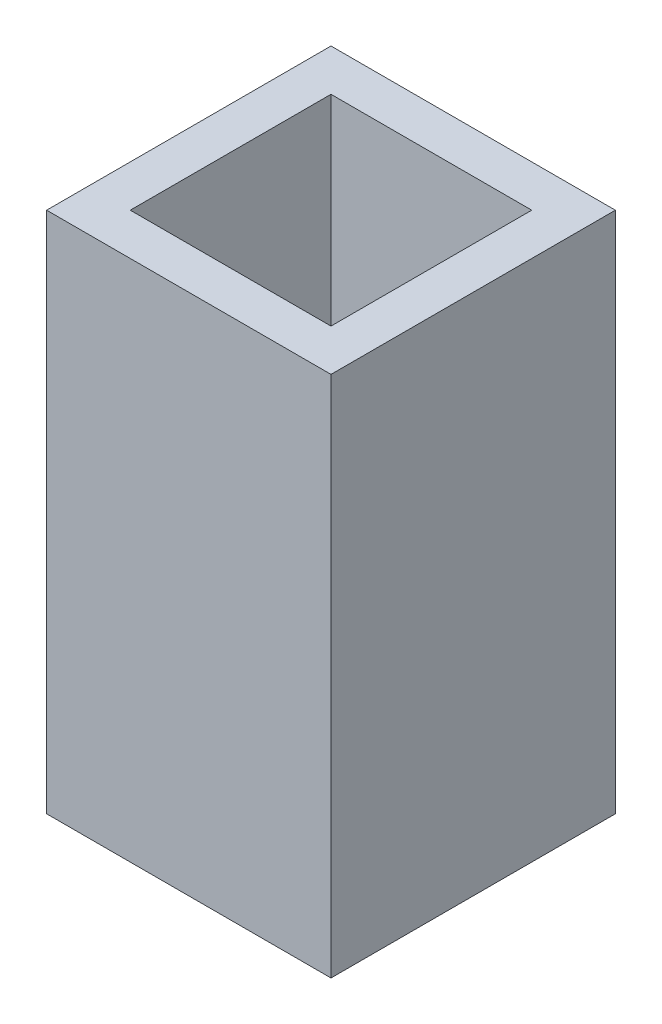
ISO-10303-21;
HEADER;
FILE_DESCRIPTION(('STEP AP214'),'2;1');
FILE_NAME('part.step','',(''),(''),'','','');
FILE_SCHEMA(('AUTOMOTIVE_DESIGN { 1 0 10303 214 1 1 1 1 }'));
ENDSEC;
DATA;
#1=APPLICATION_CONTEXT('core data for automotive mechanical design processes');
#2=APPLICATION_PROTOCOL_DEFINITION('international standard','automotive_design',2000,#1);
#3=PRODUCT_CONTEXT('',#1,'mechanical');
#4=PRODUCT('Part','Part','',(#3));
#5=PRODUCT_RELATED_PRODUCT_CATEGORY('part','',(#4));
#6=PRODUCT_DEFINITION_FORMATION('','',#4);
#7=PRODUCT_DEFINITION_CONTEXT('part definition',#1,'design');
#8=PRODUCT_DEFINITION('design','',#6,#7);
#9=PRODUCT_DEFINITION_SHAPE('','',#8);
#10=(LENGTH_UNIT() NAMED_UNIT(*) SI_UNIT(.MILLI.,.METRE.));
#11=(NAMED_UNIT(*) PLANE_ANGLE_UNIT() SI_UNIT($,.RADIAN.));
#12=(NAMED_UNIT(*) SI_UNIT($,.STERADIAN.) SOLID_ANGLE_UNIT());
#13=UNCERTAINTY_MEASURE_WITH_UNIT(LENGTH_MEASURE(1.E-05),#10,'distance_accuracy_value','');
#14=(GEOMETRIC_REPRESENTATION_CONTEXT(3) GLOBAL_UNCERTAINTY_ASSIGNED_CONTEXT((#13)) GLOBAL_UNIT_ASSIGNED_CONTEXT((#10,
#11,#12)) REPRESENTATION_CONTEXT('',''));
#15=CARTESIAN_POINT('',(0.,0.,0.));
#16=DIRECTION('',(0.,0.,1.));
#17=DIRECTION('',(1.,0.,0.));
#18=AXIS2_PLACEMENT_3D('',#15,#16,#17);
#19=CARTESIAN_POINT('',(0.,25.,0.));
#20=DIRECTION('',(0.,-1.,0.));
#21=DIRECTION('',(0.,0.,-1.));
#22=AXIS2_PLACEMENT_3D('',#19,#20,#21);
#23=PLANE('',#22);
#24=DIRECTION('',(0.,0.,-1.));
#25=VECTOR('',#24,1.);
#26=CARTESIAN_POINT('',(6.8,25.,6.8));
#27=LINE('',#26,#25);
#28=CARTESIAN_POINT('',(6.8,25.,6.8));
#29=VERTEX_POINT('',#28);
#30=CARTESIAN_POINT('',(6.8,25.,-6.8));
#31=VERTEX_POINT('',#30);
#32=EDGE_CURVE('E140',#29,#31,#27,.T.);
#33=ORIENTED_EDGE('',*,*,#32,.T.);
#34=DIRECTION('',(-1.,0.,0.));
#35=VECTOR('',#34,1.);
#36=CARTESIAN_POINT('',(-6.8,25.,-6.8));
#37=LINE('',#36,#35);
#38=CARTESIAN_POINT('',(-6.8,25.,-6.8));
#39=VERTEX_POINT('',#38);
#40=EDGE_CURVE('E143',#31,#39,#37,.T.);
#41=ORIENTED_EDGE('',*,*,#40,.T.);
#42=DIRECTION('',(0.,0.,1.));
#43=VECTOR('',#42,1.);
#44=CARTESIAN_POINT('',(-6.8,25.,6.8));
#45=LINE('',#44,#43);
#46=CARTESIAN_POINT('',(-6.8,25.,6.8));
#47=VERTEX_POINT('',#46);
#48=EDGE_CURVE('E146',#39,#47,#45,.T.);
#49=ORIENTED_EDGE('',*,*,#48,.T.);
#50=DIRECTION('',(1.,0.,0.));
#51=VECTOR('',#50,1.);
#52=CARTESIAN_POINT('',(-6.8,25.,6.8));
#53=LINE('',#52,#51);
#54=EDGE_CURVE('E148',#47,#29,#53,.T.);
#55=ORIENTED_EDGE('',*,*,#54,.T.);
#56=EDGE_LOOP('',(#33,#41,#49,#55));
#57=FACE_BOUND('',#56,.T.);
#58=DIRECTION('',(0.,0.,-1.));
#59=VECTOR('',#58,1.);
#60=CARTESIAN_POINT('',(4.8,25.,4.8));
#61=LINE('',#60,#59);
#62=CARTESIAN_POINT('',(4.8,25.,4.8));
#63=VERTEX_POINT('',#62);
#64=CARTESIAN_POINT('',(4.8,25.,-4.8));
#65=VERTEX_POINT('',#64);
#66=EDGE_CURVE('E104',#63,#65,#61,.T.);
#67=ORIENTED_EDGE('',*,*,#66,.F.);
#68=DIRECTION('',(1.,0.,0.));
#69=VECTOR('',#68,1.);
#70=CARTESIAN_POINT('',(-4.8,25.,4.8));
#71=LINE('',#70,#69);
#72=CARTESIAN_POINT('',(-4.8,25.,4.8));
#73=VERTEX_POINT('',#72);
#74=EDGE_CURVE('E126',#73,#63,#71,.T.);
#75=ORIENTED_EDGE('',*,*,#74,.F.);
#76=DIRECTION('',(0.,0.,1.));
#77=VECTOR('',#76,1.);
#78=CARTESIAN_POINT('',(-4.8,25.,4.8));
#79=LINE('',#78,#77);
#80=CARTESIAN_POINT('',(-4.8,25.,-4.8));
#81=VERTEX_POINT('',#80);
#82=EDGE_CURVE('E124',#81,#73,#79,.T.);
#83=ORIENTED_EDGE('',*,*,#82,.F.);
#84=DIRECTION('',(-1.,0.,0.));
#85=VECTOR('',#84,1.);
#86=CARTESIAN_POINT('',(-4.8,25.,-4.8));
#87=LINE('',#86,#85);
#88=EDGE_CURVE('E112',#65,#81,#87,.T.);
#89=ORIENTED_EDGE('',*,*,#88,.F.);
#90=EDGE_LOOP('',(#67,#75,#83,#89));
#91=FACE_BOUND('',#90,.T.);
#92=ADVANCED_FACE('F39',(#57,#91),#23,.F.);
#93=CARTESIAN_POINT('',(0.,0.,0.));
#94=DIRECTION('',(0.,-1.,0.));
#95=DIRECTION('',(0.,0.,-1.));
#96=AXIS2_PLACEMENT_3D('',#93,#94,#95);
#97=PLANE('',#96);
#98=DIRECTION('',(0.,0.,-1.));
#99=VECTOR('',#98,1.);
#100=CARTESIAN_POINT('',(6.8,0.,6.8));
#101=LINE('',#100,#99);
#102=CARTESIAN_POINT('',(6.8,0.,6.8));
#103=VERTEX_POINT('',#102);
#104=CARTESIAN_POINT('',(6.8,0.,-6.8));
#105=VERTEX_POINT('',#104);
#106=EDGE_CURVE('E120',#103,#105,#101,.T.);
#107=ORIENTED_EDGE('',*,*,#106,.F.);
#108=DIRECTION('',(1.,0.,0.));
#109=VECTOR('',#108,1.);
#110=CARTESIAN_POINT('',(-6.8,0.,6.8));
#111=LINE('',#110,#109);
#112=CARTESIAN_POINT('',(-6.8,0.,6.8));
#113=VERTEX_POINT('',#112);
#114=EDGE_CURVE('E144',#113,#103,#111,.T.);
#115=ORIENTED_EDGE('',*,*,#114,.F.);
#116=DIRECTION('',(0.,0.,1.));
#117=VECTOR('',#116,1.);
#118=CARTESIAN_POINT('',(-6.8,0.,6.8));
#119=LINE('',#118,#117);
#120=CARTESIAN_POINT('',(-6.8,0.,-6.8));
#121=VERTEX_POINT('',#120);
#122=EDGE_CURVE('E155',#121,#113,#119,.T.);
#123=ORIENTED_EDGE('',*,*,#122,.F.);
#124=DIRECTION('',(-1.,0.,0.));
#125=VECTOR('',#124,1.);
#126=CARTESIAN_POINT('',(-6.8,0.,-6.8));
#127=LINE('',#126,#125);
#128=EDGE_CURVE('E153',#105,#121,#127,.T.);
#129=ORIENTED_EDGE('',*,*,#128,.F.);
#130=EDGE_LOOP('',(#107,#115,#123,#129));
#131=FACE_BOUND('',#130,.T.);
#132=DIRECTION('',(1.,0.,0.));
#133=VECTOR('',#132,1.);
#134=CARTESIAN_POINT('',(-4.8,0.,4.8));
#135=LINE('',#134,#133);
#136=CARTESIAN_POINT('',(-4.8,0.,4.8));
#137=VERTEX_POINT('',#136);
#138=CARTESIAN_POINT('',(4.8,0.,4.8));
#139=VERTEX_POINT('',#138);
#140=EDGE_CURVE('E113',#137,#139,#135,.T.);
#141=ORIENTED_EDGE('',*,*,#140,.T.);
#142=DIRECTION('',(0.,0.,-1.));
#143=VECTOR('',#142,1.);
#144=CARTESIAN_POINT('',(4.8,0.,4.8));
#145=LINE('',#144,#143);
#146=CARTESIAN_POINT('',(4.8,0.,-4.8));
#147=VERTEX_POINT('',#146);
#148=EDGE_CURVE('E62',#139,#147,#145,.T.);
#149=ORIENTED_EDGE('',*,*,#148,.T.);
#150=DIRECTION('',(-1.,0.,0.));
#151=VECTOR('',#150,1.);
#152=CARTESIAN_POINT('',(-4.8,0.,-4.8));
#153=LINE('',#152,#151);
#154=CARTESIAN_POINT('',(-4.8,0.,-4.8));
#155=VERTEX_POINT('',#154);
#156=EDGE_CURVE('E119',#147,#155,#153,.T.);
#157=ORIENTED_EDGE('',*,*,#156,.T.);
#158=DIRECTION('',(0.,0.,1.));
#159=VECTOR('',#158,1.);
#160=CARTESIAN_POINT('',(-4.8,0.,4.8));
#161=LINE('',#160,#159);
#162=EDGE_CURVE('E132',#155,#137,#161,.T.);
#163=ORIENTED_EDGE('',*,*,#162,.T.);
#164=EDGE_LOOP('',(#141,#149,#157,#163));
#165=FACE_BOUND('',#164,.T.);
#166=ADVANCED_FACE('F173',(#131,#165),#97,.T.);
#167=CARTESIAN_POINT('',(6.8,25.,6.8));
#168=DIRECTION('',(-1.,0.,0.));
#169=DIRECTION('',(0.,0.,1.));
#170=AXIS2_PLACEMENT_3D('',#167,#168,#169);
#171=PLANE('',#170);
#172=ORIENTED_EDGE('',*,*,#106,.T.);
#173=DIRECTION('',(0.,-1.,0.));
#174=VECTOR('',#173,1.);
#175=CARTESIAN_POINT('',(6.8,25.,-6.8));
#176=LINE('',#175,#174);
#177=EDGE_CURVE('E11',#31,#105,#176,.T.);
#178=ORIENTED_EDGE('',*,*,#177,.F.);
#179=ORIENTED_EDGE('',*,*,#32,.F.);
#180=DIRECTION('',(0.,-1.,0.));
#181=VECTOR('',#180,1.);
#182=CARTESIAN_POINT('',(6.8,25.,6.8));
#183=LINE('',#182,#181);
#184=EDGE_CURVE('E150',#29,#103,#183,.T.);
#185=ORIENTED_EDGE('',*,*,#184,.T.);
#186=EDGE_LOOP('',(#172,#178,#179,#185));
#187=FACE_BOUND('',#186,.T.);
#188=ADVANCED_FACE('F41',(#187),#171,.F.);
#189=CARTESIAN_POINT('',(-6.8,25.,-6.8));
#190=DIRECTION('',(0.,0.,1.));
#191=DIRECTION('',(1.,0.,0.));
#192=AXIS2_PLACEMENT_3D('',#189,#190,#191);
#193=PLANE('',#192);
#194=ORIENTED_EDGE('',*,*,#128,.T.);
#195=DIRECTION('',(0.,-1.,0.));
#196=VECTOR('',#195,1.);
#197=CARTESIAN_POINT('',(-6.8,25.,-6.8));
#198=LINE('',#197,#196);
#199=EDGE_CURVE('E47',#39,#121,#198,.T.);
#200=ORIENTED_EDGE('',*,*,#199,.F.);
#201=ORIENTED_EDGE('',*,*,#40,.F.);
#202=ORIENTED_EDGE('',*,*,#177,.T.);
#203=EDGE_LOOP('',(#194,#200,#201,#202));
#204=FACE_BOUND('',#203,.T.);
#205=ADVANCED_FACE('F183',(#204),#193,.F.);
#206=CARTESIAN_POINT('',(-6.8,25.,6.8));
#207=DIRECTION('',(1.,0.,0.));
#208=DIRECTION('',(0.,0.,-1.));
#209=AXIS2_PLACEMENT_3D('',#206,#207,#208);
#210=PLANE('',#209);
#211=ORIENTED_EDGE('',*,*,#122,.T.);
#212=DIRECTION('',(0.,-1.,0.));
#213=VECTOR('',#212,1.);
#214=CARTESIAN_POINT('',(-6.8,25.,6.8));
#215=LINE('',#214,#213);
#216=EDGE_CURVE('E160',#47,#113,#215,.T.);
#217=ORIENTED_EDGE('',*,*,#216,.F.);
#218=ORIENTED_EDGE('',*,*,#48,.F.);
#219=ORIENTED_EDGE('',*,*,#199,.T.);
#220=EDGE_LOOP('',(#211,#217,#218,#219));
#221=FACE_BOUND('',#220,.T.);
#222=ADVANCED_FACE('F167',(#221),#210,.F.);
#223=CARTESIAN_POINT('',(-6.8,25.,6.8));
#224=DIRECTION('',(0.,0.,-1.));
#225=DIRECTION('',(-1.,0.,0.));
#226=AXIS2_PLACEMENT_3D('',#223,#224,#225);
#227=PLANE('',#226);
#228=ORIENTED_EDGE('',*,*,#114,.T.);
#229=ORIENTED_EDGE('',*,*,#184,.F.);
#230=ORIENTED_EDGE('',*,*,#54,.F.);
#231=ORIENTED_EDGE('',*,*,#216,.T.);
#232=EDGE_LOOP('',(#228,#229,#230,#231));
#233=FACE_BOUND('',#232,.T.);
#234=ADVANCED_FACE('F177',(#233),#227,.F.);
#235=CARTESIAN_POINT('',(4.8,25.,4.8));
#236=DIRECTION('',(-1.,0.,0.));
#237=DIRECTION('',(0.,0.,1.));
#238=AXIS2_PLACEMENT_3D('',#235,#236,#237);
#239=PLANE('',#238);
#240=ORIENTED_EDGE('',*,*,#148,.F.);
#241=DIRECTION('',(0.,-1.,0.));
#242=VECTOR('',#241,1.);
#243=CARTESIAN_POINT('',(4.8,25.,4.8));
#244=LINE('',#243,#242);
#245=EDGE_CURVE('E108',#63,#139,#244,.T.);
#246=ORIENTED_EDGE('',*,*,#245,.F.);
#247=ORIENTED_EDGE('',*,*,#66,.T.);
#248=DIRECTION('',(0.,-1.,0.));
#249=VECTOR('',#248,1.);
#250=CARTESIAN_POINT('',(4.8,25.,-4.8));
#251=LINE('',#250,#249);
#252=EDGE_CURVE('E107',#65,#147,#251,.T.);
#253=ORIENTED_EDGE('',*,*,#252,.T.);
#254=EDGE_LOOP('',(#240,#246,#247,#253));
#255=FACE_BOUND('',#254,.T.);
#256=ADVANCED_FACE('F106',(#255),#239,.T.);
#257=CARTESIAN_POINT('',(-4.8,25.,-4.8));
#258=DIRECTION('',(0.,0.,1.));
#259=DIRECTION('',(1.,0.,0.));
#260=AXIS2_PLACEMENT_3D('',#257,#258,#259);
#261=PLANE('',#260);
#262=ORIENTED_EDGE('',*,*,#156,.F.);
#263=ORIENTED_EDGE('',*,*,#252,.F.);
#264=ORIENTED_EDGE('',*,*,#88,.T.);
#265=DIRECTION('',(0.,-1.,0.));
#266=VECTOR('',#265,1.);
#267=CARTESIAN_POINT('',(-4.8,25.,-4.8));
#268=LINE('',#267,#266);
#269=EDGE_CURVE('E121',#81,#155,#268,.T.);
#270=ORIENTED_EDGE('',*,*,#269,.T.);
#271=EDGE_LOOP('',(#262,#263,#264,#270));
#272=FACE_BOUND('',#271,.T.);
#273=ADVANCED_FACE('F116',(#272),#261,.T.);
#274=CARTESIAN_POINT('',(-4.8,25.,4.8));
#275=DIRECTION('',(1.,0.,0.));
#276=DIRECTION('',(0.,0.,-1.));
#277=AXIS2_PLACEMENT_3D('',#274,#275,#276);
#278=PLANE('',#277);
#279=ORIENTED_EDGE('',*,*,#162,.F.);
#280=ORIENTED_EDGE('',*,*,#269,.F.);
#281=ORIENTED_EDGE('',*,*,#82,.T.);
#282=DIRECTION('',(0.,-1.,0.));
#283=VECTOR('',#282,1.);
#284=CARTESIAN_POINT('',(-4.8,25.,4.8));
#285=LINE('',#284,#283);
#286=EDGE_CURVE('E54',#73,#137,#285,.T.);
#287=ORIENTED_EDGE('',*,*,#286,.T.);
#288=EDGE_LOOP('',(#279,#280,#281,#287));
#289=FACE_BOUND('',#288,.T.);
#290=ADVANCED_FACE('F206',(#289),#278,.T.);
#291=CARTESIAN_POINT('',(-4.8,25.,4.8));
#292=DIRECTION('',(0.,0.,-1.));
#293=DIRECTION('',(-1.,0.,0.));
#294=AXIS2_PLACEMENT_3D('',#291,#292,#293);
#295=PLANE('',#294);
#296=ORIENTED_EDGE('',*,*,#140,.F.);
#297=ORIENTED_EDGE('',*,*,#286,.F.);
#298=ORIENTED_EDGE('',*,*,#74,.T.);
#299=ORIENTED_EDGE('',*,*,#245,.T.);
#300=EDGE_LOOP('',(#296,#297,#298,#299));
#301=FACE_BOUND('',#300,.T.);
#302=ADVANCED_FACE('F210',(#301),#295,.T.);
#303=CLOSED_SHELL('',(#92,#166,#188,#205,#222,#234,#256,#273,#290,#302));
#304=MANIFOLD_SOLID_BREP('B2',#303);
#305=ADVANCED_BREP_SHAPE_REPRESENTATION('',(#18,#304),#14);
#306=SHAPE_DEFINITION_REPRESENTATION(#9,#305);
ENDSEC;
END-ISO-10303-21;
